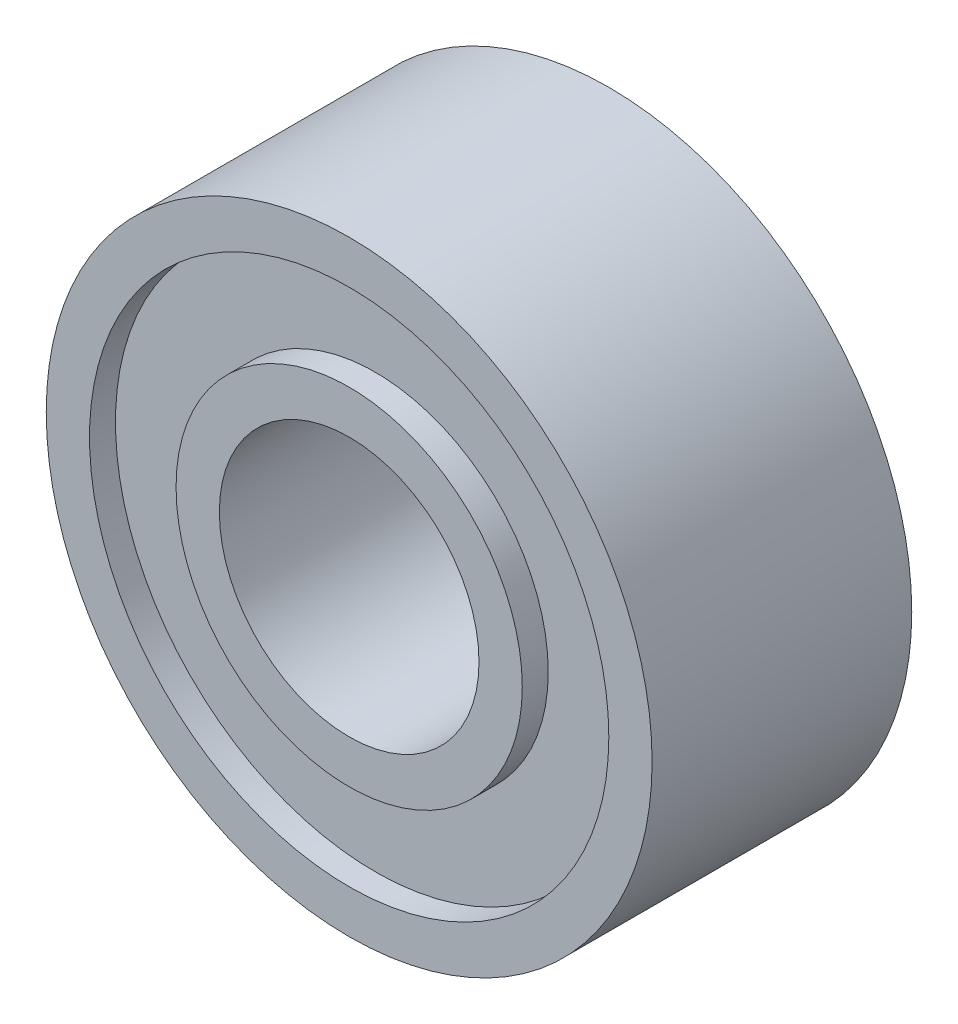
ISO-10303-21;
HEADER;
FILE_DESCRIPTION(('STEP AP214'),'2;1');
FILE_NAME('part.step','',(''),(''),'','','');
FILE_SCHEMA(('AUTOMOTIVE_DESIGN { 1 0 10303 214 1 1 1 1 }'));
ENDSEC;
DATA;
#1=APPLICATION_CONTEXT('core data for automotive mechanical design processes');
#2=APPLICATION_PROTOCOL_DEFINITION('international standard','automotive_design',2000,#1);
#3=PRODUCT_CONTEXT('',#1,'mechanical');
#4=PRODUCT('Part','Part','',(#3));
#5=PRODUCT_RELATED_PRODUCT_CATEGORY('part','',(#4));
#6=PRODUCT_DEFINITION_FORMATION('','',#4);
#7=PRODUCT_DEFINITION_CONTEXT('part definition',#1,'design');
#8=PRODUCT_DEFINITION('design','',#6,#7);
#9=PRODUCT_DEFINITION_SHAPE('','',#8);
#10=(LENGTH_UNIT() NAMED_UNIT(*) SI_UNIT(.MILLI.,.METRE.));
#11=(NAMED_UNIT(*) PLANE_ANGLE_UNIT() SI_UNIT($,.RADIAN.));
#12=(NAMED_UNIT(*) SI_UNIT($,.STERADIAN.) SOLID_ANGLE_UNIT());
#13=UNCERTAINTY_MEASURE_WITH_UNIT(LENGTH_MEASURE(1.E-05),#10,'distance_accuracy_value','');
#14=(GEOMETRIC_REPRESENTATION_CONTEXT(3) GLOBAL_UNCERTAINTY_ASSIGNED_CONTEXT((#13)) GLOBAL_UNIT_ASSIGNED_CONTEXT((#10,
#11,#12)) REPRESENTATION_CONTEXT('',''));
#15=CARTESIAN_POINT('',(0.,0.,0.));
#16=DIRECTION('',(0.,0.,1.));
#17=DIRECTION('',(1.,0.,0.));
#18=AXIS2_PLACEMENT_3D('',#15,#16,#17);
#19=CARTESIAN_POINT('',(0.,0.,0.));
#20=DIRECTION('',(0.,0.,1.));
#21=DIRECTION('',(1.,0.,0.));
#22=AXIS2_PLACEMENT_3D('',#19,#20,#21);
#23=PLANE('',#22);
#24=CARTESIAN_POINT('',(0.,0.,0.));
#25=DIRECTION('',(0.,0.,1.));
#26=DIRECTION('',(1.,0.,0.));
#27=AXIS2_PLACEMENT_3D('',#24,#25,#26);
#28=CIRCLE('',#27,1.5);
#29=CARTESIAN_POINT('',(1.5,0.,0.));
#30=VERTEX_POINT('',#29);
#31=EDGE_CURVE('E46',#30,#30,#28,.T.);
#32=ORIENTED_EDGE('',*,*,#31,.T.);
#33=EDGE_LOOP('',(#32));
#34=FACE_BOUND('',#33,.T.);
#35=CARTESIAN_POINT('',(0.,0.,0.));
#36=DIRECTION('',(0.,0.,1.));
#37=DIRECTION('',(1.,0.,0.));
#38=AXIS2_PLACEMENT_3D('',#35,#36,#37);
#39=CIRCLE('',#38,2.);
#40=CARTESIAN_POINT('',(2.,0.,0.));
#41=VERTEX_POINT('',#40);
#42=EDGE_CURVE('E70',#41,#41,#39,.T.);
#43=ORIENTED_EDGE('',*,*,#42,.F.);
#44=EDGE_LOOP('',(#43));
#45=FACE_BOUND('',#44,.T.);
#46=ADVANCED_FACE('F33',(#34,#45),#23,.F.);
#47=CARTESIAN_POINT('',(0.,0.,3.));
#48=DIRECTION('',(0.,0.,1.));
#49=DIRECTION('',(1.,0.,0.));
#50=AXIS2_PLACEMENT_3D('',#47,#48,#49);
#51=PLANE('',#50);
#52=CARTESIAN_POINT('',(0.,0.,3.));
#53=DIRECTION('',(0.,0.,1.));
#54=DIRECTION('',(1.,0.,0.));
#55=AXIS2_PLACEMENT_3D('',#52,#53,#54);
#56=CIRCLE('',#55,1.5);
#57=CARTESIAN_POINT('',(1.5,0.,3.));
#58=VERTEX_POINT('',#57);
#59=EDGE_CURVE('E44',#58,#58,#56,.T.);
#60=ORIENTED_EDGE('',*,*,#59,.F.);
#61=EDGE_LOOP('',(#60));
#62=FACE_BOUND('',#61,.T.);
#63=CARTESIAN_POINT('',(0.,0.,3.));
#64=DIRECTION('',(0.,0.,1.));
#65=DIRECTION('',(1.,0.,0.));
#66=AXIS2_PLACEMENT_3D('',#63,#64,#65);
#67=CIRCLE('',#66,2.);
#68=CARTESIAN_POINT('',(2.,0.,3.));
#69=VERTEX_POINT('',#68);
#70=EDGE_CURVE('E58',#69,#69,#67,.T.);
#71=ORIENTED_EDGE('',*,*,#70,.T.);
#72=EDGE_LOOP('',(#71));
#73=FACE_BOUND('',#72,.T.);
#74=ADVANCED_FACE('F86',(#62,#73),#51,.T.);
#75=CARTESIAN_POINT('',(0.,0.,3.));
#76=DIRECTION('',(0.,0.,1.));
#77=DIRECTION('',(1.,0.,0.));
#78=AXIS2_PLACEMENT_3D('',#75,#76,#77);
#79=CIRCLE('',#78,3.);
#80=CARTESIAN_POINT('',(3.,0.,3.));
#81=VERTEX_POINT('',#80);
#82=EDGE_CURVE('E52',#81,#81,#79,.T.);
#83=ORIENTED_EDGE('',*,*,#82,.F.);
#84=EDGE_LOOP('',(#83));
#85=FACE_BOUND('',#84,.T.);
#86=CARTESIAN_POINT('',(0.,0.,3.));
#87=DIRECTION('',(0.,0.,1.));
#88=DIRECTION('',(1.,0.,0.));
#89=AXIS2_PLACEMENT_3D('',#86,#87,#88);
#90=CIRCLE('',#89,3.5);
#91=CARTESIAN_POINT('',(3.5,0.,3.));
#92=VERTEX_POINT('',#91);
#93=EDGE_CURVE('E10',#92,#92,#90,.T.);
#94=ORIENTED_EDGE('',*,*,#93,.T.);
#95=EDGE_LOOP('',(#94));
#96=FACE_BOUND('',#95,.T.);
#97=ADVANCED_FACE('F92',(#85,#96),#51,.T.);
#98=CARTESIAN_POINT('',(0.,0.,0.));
#99=DIRECTION('',(0.,0.,1.));
#100=DIRECTION('',(1.,0.,0.));
#101=AXIS2_PLACEMENT_3D('',#98,#99,#100);
#102=CIRCLE('',#101,3.);
#103=CARTESIAN_POINT('',(3.,0.,0.));
#104=VERTEX_POINT('',#103);
#105=EDGE_CURVE('E64',#104,#104,#102,.T.);
#106=ORIENTED_EDGE('',*,*,#105,.T.);
#107=EDGE_LOOP('',(#106));
#108=FACE_BOUND('',#107,.T.);
#109=CARTESIAN_POINT('',(0.,0.,0.));
#110=DIRECTION('',(0.,0.,1.));
#111=DIRECTION('',(1.,0.,0.));
#112=AXIS2_PLACEMENT_3D('',#109,#110,#111);
#113=CIRCLE('',#112,3.5);
#114=CARTESIAN_POINT('',(3.5,0.,0.));
#115=VERTEX_POINT('',#114);
#116=EDGE_CURVE('E37',#115,#115,#113,.T.);
#117=ORIENTED_EDGE('',*,*,#116,.F.);
#118=EDGE_LOOP('',(#117));
#119=FACE_BOUND('',#118,.T.);
#120=ADVANCED_FACE('F88',(#108,#119),#23,.F.);
#121=CARTESIAN_POINT('',(0.,0.,3.));
#122=DIRECTION('',(0.,0.,-1.));
#123=DIRECTION('',(-1.,0.,0.));
#124=AXIS2_PLACEMENT_3D('',#121,#122,#123);
#125=CYLINDRICAL_SURFACE('',#124,3.5);
#126=ORIENTED_EDGE('',*,*,#93,.F.);
#127=EDGE_LOOP('',(#126));
#128=FACE_BOUND('',#127,.T.);
#129=ORIENTED_EDGE('',*,*,#116,.T.);
#130=EDGE_LOOP('',(#129));
#131=FACE_BOUND('',#130,.T.);
#132=ADVANCED_FACE('F35',(#128,#131),#125,.T.);
#133=CARTESIAN_POINT('',(0.,0.,3.));
#134=DIRECTION('',(0.,0.,-1.));
#135=DIRECTION('',(-1.,0.,0.));
#136=AXIS2_PLACEMENT_3D('',#133,#134,#135);
#137=CYLINDRICAL_SURFACE('',#136,1.5);
#138=ORIENTED_EDGE('',*,*,#59,.T.);
#139=EDGE_LOOP('',(#138));
#140=FACE_BOUND('',#139,.T.);
#141=ORIENTED_EDGE('',*,*,#31,.F.);
#142=EDGE_LOOP('',(#141));
#143=FACE_BOUND('',#142,.T.);
#144=ADVANCED_FACE('F101',(#140,#143),#137,.F.);
#145=CARTESIAN_POINT('',(0.,0.,2.7));
#146=DIRECTION('',(0.,0.,1.));
#147=DIRECTION('',(1.,0.,0.));
#148=AXIS2_PLACEMENT_3D('',#145,#146,#147);
#149=CYLINDRICAL_SURFACE('',#148,3.);
#150=CARTESIAN_POINT('',(0.,0.,2.7));
#151=DIRECTION('',(0.,0.,1.));
#152=DIRECTION('',(1.,0.,0.));
#153=AXIS2_PLACEMENT_3D('',#150,#151,#152);
#154=CIRCLE('',#153,3.);
#155=CARTESIAN_POINT('',(3.,0.,2.7));
#156=VERTEX_POINT('',#155);
#157=EDGE_CURVE('E49',#156,#156,#154,.T.);
#158=ORIENTED_EDGE('',*,*,#157,.F.);
#159=EDGE_LOOP('',(#158));
#160=FACE_BOUND('',#159,.T.);
#161=ORIENTED_EDGE('',*,*,#82,.T.);
#162=EDGE_LOOP('',(#161));
#163=FACE_BOUND('',#162,.T.);
#164=ADVANCED_FACE('F125',(#160,#163),#149,.F.);
#165=CARTESIAN_POINT('',(0.,0.,2.7));
#166=DIRECTION('',(0.,0.,1.));
#167=DIRECTION('',(1.,0.,0.));
#168=AXIS2_PLACEMENT_3D('',#165,#166,#167);
#169=PLANE('',#168);
#170=CARTESIAN_POINT('',(0.,0.,2.7));
#171=DIRECTION('',(0.,0.,1.));
#172=DIRECTION('',(1.,0.,0.));
#173=AXIS2_PLACEMENT_3D('',#170,#171,#172);
#174=CIRCLE('',#173,2.);
#175=CARTESIAN_POINT('',(2.,0.,2.7));
#176=VERTEX_POINT('',#175);
#177=EDGE_CURVE('E55',#176,#176,#174,.T.);
#178=ORIENTED_EDGE('',*,*,#177,.F.);
#179=EDGE_LOOP('',(#178));
#180=FACE_BOUND('',#179,.T.);
#181=ORIENTED_EDGE('',*,*,#157,.T.);
#182=EDGE_LOOP('',(#181));
#183=FACE_BOUND('',#182,.T.);
#184=ADVANCED_FACE('F121',(#180,#183),#169,.T.);
#185=CARTESIAN_POINT('',(0.,0.,2.7));
#186=DIRECTION('',(0.,0.,1.));
#187=DIRECTION('',(1.,0.,0.));
#188=AXIS2_PLACEMENT_3D('',#185,#186,#187);
#189=CYLINDRICAL_SURFACE('',#188,2.);
#190=ORIENTED_EDGE('',*,*,#177,.T.);
#191=EDGE_LOOP('',(#190));
#192=FACE_BOUND('',#191,.T.);
#193=ORIENTED_EDGE('',*,*,#70,.F.);
#194=EDGE_LOOP('',(#193));
#195=FACE_BOUND('',#194,.T.);
#196=ADVANCED_FACE('F115',(#192,#195),#189,.T.);
#197=CARTESIAN_POINT('',(0.,0.,0.3));
#198=DIRECTION('',(0.,0.,1.));
#199=DIRECTION('',(1.,0.,0.));
#200=AXIS2_PLACEMENT_3D('',#197,#198,#199);
#201=PLANE('',#200);
#202=CARTESIAN_POINT('',(0.,0.,0.3));
#203=DIRECTION('',(0.,0.,1.));
#204=DIRECTION('',(1.,0.,0.));
#205=AXIS2_PLACEMENT_3D('',#202,#203,#204);
#206=CIRCLE('',#205,3.);
#207=CARTESIAN_POINT('',(3.,0.,0.3));
#208=VERTEX_POINT('',#207);
#209=EDGE_CURVE('E61',#208,#208,#206,.T.);
#210=ORIENTED_EDGE('',*,*,#209,.F.);
#211=EDGE_LOOP('',(#210));
#212=FACE_BOUND('',#211,.T.);
#213=CARTESIAN_POINT('',(0.,0.,0.3));
#214=DIRECTION('',(0.,0.,1.));
#215=DIRECTION('',(1.,0.,0.));
#216=AXIS2_PLACEMENT_3D('',#213,#214,#215);
#217=CIRCLE('',#216,2.);
#218=CARTESIAN_POINT('',(2.,0.,0.3));
#219=VERTEX_POINT('',#218);
#220=EDGE_CURVE('E67',#219,#219,#217,.T.);
#221=ORIENTED_EDGE('',*,*,#220,.T.);
#222=EDGE_LOOP('',(#221));
#223=FACE_BOUND('',#222,.T.);
#224=ADVANCED_FACE('F76',(#212,#223),#201,.F.);
#225=CARTESIAN_POINT('',(0.,0.,0.3));
#226=DIRECTION('',(0.,0.,-1.));
#227=DIRECTION('',(-1.,0.,0.));
#228=AXIS2_PLACEMENT_3D('',#225,#226,#227);
#229=CYLINDRICAL_SURFACE('',#228,3.);
#230=ORIENTED_EDGE('',*,*,#209,.T.);
#231=EDGE_LOOP('',(#230));
#232=FACE_BOUND('',#231,.T.);
#233=ORIENTED_EDGE('',*,*,#105,.F.);
#234=EDGE_LOOP('',(#233));
#235=FACE_BOUND('',#234,.T.);
#236=ADVANCED_FACE('F81',(#232,#235),#229,.F.);
#237=CARTESIAN_POINT('',(0.,0.,0.3));
#238=DIRECTION('',(0.,0.,-1.));
#239=DIRECTION('',(-1.,0.,0.));
#240=AXIS2_PLACEMENT_3D('',#237,#238,#239);
#241=CYLINDRICAL_SURFACE('',#240,2.);
#242=ORIENTED_EDGE('',*,*,#220,.F.);
#243=EDGE_LOOP('',(#242));
#244=FACE_BOUND('',#243,.T.);
#245=ORIENTED_EDGE('',*,*,#42,.T.);
#246=EDGE_LOOP('',(#245));
#247=FACE_BOUND('',#246,.T.);
#248=ADVANCED_FACE('F78',(#244,#247),#241,.T.);
#249=CLOSED_SHELL('',(#46,#74,#97,#120,#132,#144,#164,#184,#196,#224,#236,#248));
#250=MANIFOLD_SOLID_BREP('B2',#249);
#251=ADVANCED_BREP_SHAPE_REPRESENTATION('',(#18,#250),#14);
#252=SHAPE_DEFINITION_REPRESENTATION(#9,#251);
ENDSEC;
END-ISO-10303-21;
